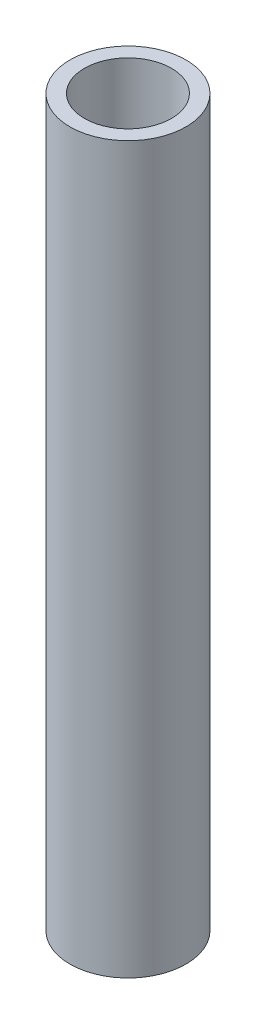
ISO-10303-21;
HEADER;
FILE_DESCRIPTION(('STEP AP214'),'2;1');
FILE_NAME('part.step','',(''),(''),'','','');
FILE_SCHEMA(('AUTOMOTIVE_DESIGN { 1 0 10303 214 1 1 1 1 }'));
ENDSEC;
DATA;
#1=APPLICATION_CONTEXT('core data for automotive mechanical design processes');
#2=APPLICATION_PROTOCOL_DEFINITION('international standard','automotive_design',2000,#1);
#3=PRODUCT_CONTEXT('',#1,'mechanical');
#4=PRODUCT('Part','Part','',(#3));
#5=PRODUCT_RELATED_PRODUCT_CATEGORY('part','',(#4));
#6=PRODUCT_DEFINITION_FORMATION('','',#4);
#7=PRODUCT_DEFINITION_CONTEXT('part definition',#1,'design');
#8=PRODUCT_DEFINITION('design','',#6,#7);
#9=PRODUCT_DEFINITION_SHAPE('','',#8);
#10=(LENGTH_UNIT() NAMED_UNIT(*) SI_UNIT(.MILLI.,.METRE.));
#11=(NAMED_UNIT(*) PLANE_ANGLE_UNIT() SI_UNIT($,.RADIAN.));
#12=(NAMED_UNIT(*) SI_UNIT($,.STERADIAN.) SOLID_ANGLE_UNIT());
#13=UNCERTAINTY_MEASURE_WITH_UNIT(LENGTH_MEASURE(1.E-05),#10,'distance_accuracy_value','');
#14=(GEOMETRIC_REPRESENTATION_CONTEXT(3) GLOBAL_UNCERTAINTY_ASSIGNED_CONTEXT((#13)) GLOBAL_UNIT_ASSIGNED_CONTEXT((#10,
#11,#12)) REPRESENTATION_CONTEXT('',''));
#15=CARTESIAN_POINT('',(0.,0.,0.));
#16=DIRECTION('',(0.,0.,1.));
#17=DIRECTION('',(1.,0.,0.));
#18=AXIS2_PLACEMENT_3D('',#15,#16,#17);
#19=CARTESIAN_POINT('',(0.,25.,0.));
#20=DIRECTION('',(0.,1.,0.));
#21=DIRECTION('',(0.,0.,1.));
#22=AXIS2_PLACEMENT_3D('',#19,#20,#21);
#23=PLANE('',#22);
#24=CARTESIAN_POINT('',(0.,25.,0.));
#25=DIRECTION('',(0.,1.,0.));
#26=DIRECTION('',(0.,0.,1.));
#27=AXIS2_PLACEMENT_3D('',#24,#25,#26);
#28=CIRCLE('',#27,2.);
#29=CARTESIAN_POINT('',(0.,25.,2.));
#30=VERTEX_POINT('',#29);
#31=EDGE_CURVE('E10',#30,#30,#28,.T.);
#32=ORIENTED_EDGE('',*,*,#31,.T.);
#33=EDGE_LOOP('',(#32));
#34=FACE_BOUND('',#33,.T.);
#35=CARTESIAN_POINT('',(0.,25.,0.));
#36=DIRECTION('',(0.,1.,0.));
#37=DIRECTION('',(0.,0.,1.));
#38=AXIS2_PLACEMENT_3D('',#35,#36,#37);
#39=CIRCLE('',#38,1.5);
#40=CARTESIAN_POINT('',(0.,25.,1.5));
#41=VERTEX_POINT('',#40);
#42=EDGE_CURVE('E44',#41,#41,#39,.T.);
#43=ORIENTED_EDGE('',*,*,#42,.F.);
#44=EDGE_LOOP('',(#43));
#45=FACE_BOUND('',#44,.T.);
#46=ADVANCED_FACE('F33',(#34,#45),#23,.T.);
#47=CARTESIAN_POINT('',(0.,0.,0.));
#48=DIRECTION('',(0.,1.,0.));
#49=DIRECTION('',(0.,0.,1.));
#50=AXIS2_PLACEMENT_3D('',#47,#48,#49);
#51=PLANE('',#50);
#52=CARTESIAN_POINT('',(0.,0.,0.));
#53=DIRECTION('',(0.,1.,0.));
#54=DIRECTION('',(0.,0.,1.));
#55=AXIS2_PLACEMENT_3D('',#52,#53,#54);
#56=CIRCLE('',#55,2.);
#57=CARTESIAN_POINT('',(0.,0.,2.));
#58=VERTEX_POINT('',#57);
#59=EDGE_CURVE('E37',#58,#58,#56,.T.);
#60=ORIENTED_EDGE('',*,*,#59,.F.);
#61=EDGE_LOOP('',(#60));
#62=FACE_BOUND('',#61,.T.);
#63=CARTESIAN_POINT('',(0.,0.,0.));
#64=DIRECTION('',(0.,1.,0.));
#65=DIRECTION('',(0.,0.,1.));
#66=AXIS2_PLACEMENT_3D('',#63,#64,#65);
#67=CIRCLE('',#66,1.5);
#68=CARTESIAN_POINT('',(0.,0.,1.5));
#69=VERTEX_POINT('',#68);
#70=EDGE_CURVE('E46',#69,#69,#67,.T.);
#71=ORIENTED_EDGE('',*,*,#70,.T.);
#72=EDGE_LOOP('',(#71));
#73=FACE_BOUND('',#72,.T.);
#74=ADVANCED_FACE('F56',(#62,#73),#51,.F.);
#75=CARTESIAN_POINT('',(0.,25.,0.));
#76=DIRECTION('',(0.,-1.,0.));
#77=DIRECTION('',(0.,0.,-1.));
#78=AXIS2_PLACEMENT_3D('',#75,#76,#77);
#79=CYLINDRICAL_SURFACE('',#78,2.);
#80=ORIENTED_EDGE('',*,*,#31,.F.);
#81=EDGE_LOOP('',(#80));
#82=FACE_BOUND('',#81,.T.);
#83=ORIENTED_EDGE('',*,*,#59,.T.);
#84=EDGE_LOOP('',(#83));
#85=FACE_BOUND('',#84,.T.);
#86=ADVANCED_FACE('F35',(#82,#85),#79,.T.);
#87=CARTESIAN_POINT('',(0.,25.,0.));
#88=DIRECTION('',(0.,-1.,0.));
#89=DIRECTION('',(0.,0.,-1.));
#90=AXIS2_PLACEMENT_3D('',#87,#88,#89);
#91=CYLINDRICAL_SURFACE('',#90,1.5);
#92=ORIENTED_EDGE('',*,*,#42,.T.);
#93=EDGE_LOOP('',(#92));
#94=FACE_BOUND('',#93,.T.);
#95=ORIENTED_EDGE('',*,*,#70,.F.);
#96=EDGE_LOOP('',(#95));
#97=FACE_BOUND('',#96,.T.);
#98=ADVANCED_FACE('F52',(#94,#97),#91,.F.);
#99=CLOSED_SHELL('',(#46,#74,#86,#98));
#100=MANIFOLD_SOLID_BREP('B2',#99);
#101=ADVANCED_BREP_SHAPE_REPRESENTATION('',(#18,#100),#14);
#102=SHAPE_DEFINITION_REPRESENTATION(#9,#101);
ENDSEC;
END-ISO-10303-21;
